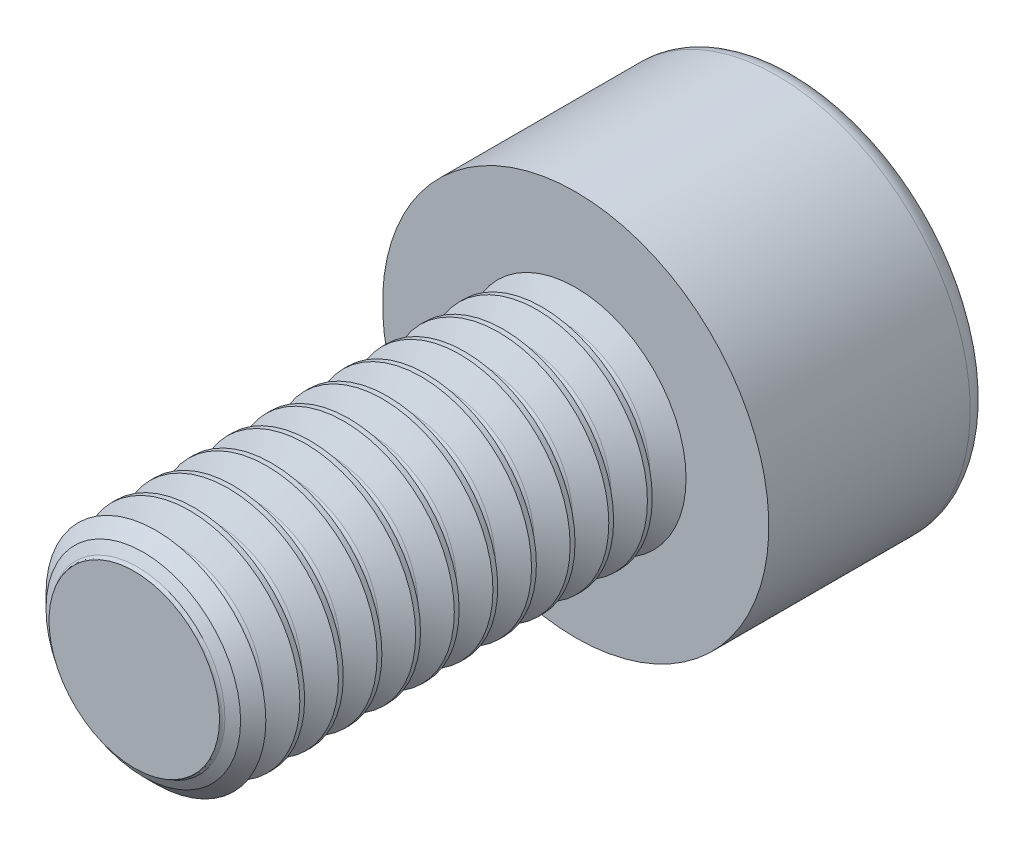
ISO-10303-21;
HEADER;
FILE_DESCRIPTION(('STEP AP214'),'2;1');
FILE_NAME('part.step','',(''),(''),'','','');
FILE_SCHEMA(('AUTOMOTIVE_DESIGN { 1 0 10303 214 1 1 1 1 }'));
ENDSEC;
DATA;
#1=APPLICATION_CONTEXT('core data for automotive mechanical design processes');
#2=APPLICATION_PROTOCOL_DEFINITION('international standard','automotive_design',2000,#1);
#3=PRODUCT_CONTEXT('',#1,'mechanical');
#4=PRODUCT('Part','Part','',(#3));
#5=PRODUCT_RELATED_PRODUCT_CATEGORY('part','',(#4));
#6=PRODUCT_DEFINITION_FORMATION('','',#4);
#7=PRODUCT_DEFINITION_CONTEXT('part definition',#1,'design');
#8=PRODUCT_DEFINITION('design','',#6,#7);
#9=PRODUCT_DEFINITION_SHAPE('','',#8);
#10=(LENGTH_UNIT() NAMED_UNIT(*) SI_UNIT(.MILLI.,.METRE.));
#11=(NAMED_UNIT(*) PLANE_ANGLE_UNIT() SI_UNIT($,.RADIAN.));
#12=(NAMED_UNIT(*) SI_UNIT($,.STERADIAN.) SOLID_ANGLE_UNIT());
#13=UNCERTAINTY_MEASURE_WITH_UNIT(LENGTH_MEASURE(1.E-05),#10,'distance_accuracy_value','');
#14=(GEOMETRIC_REPRESENTATION_CONTEXT(3) GLOBAL_UNCERTAINTY_ASSIGNED_CONTEXT((#13)) GLOBAL_UNIT_ASSIGNED_CONTEXT((#10,
#11,#12)) REPRESENTATION_CONTEXT('',''));
#15=CARTESIAN_POINT('',(0.,0.,0.));
#16=DIRECTION('',(0.,0.,1.));
#17=DIRECTION('',(1.,0.,0.));
#18=AXIS2_PLACEMENT_3D('',#15,#16,#17);
#19=CARTESIAN_POINT('',(0.,0.,-4.));
#20=DIRECTION('',(0.,0.,1.));
#21=DIRECTION('',(0.,-1.,0.));
#22=AXIS2_PLACEMENT_3D('',#19,#20,#21);
#23=PLANE('',#22);
#24=CARTESIAN_POINT('',(0.,0.,-4.));
#25=DIRECTION('',(0.,0.,-1.));
#26=DIRECTION('',(0.,1.,0.));
#27=AXIS2_PLACEMENT_3D('',#24,#25,#26);
#28=CIRCLE('',#27,3.15);
#29=CARTESIAN_POINT('',(0.,3.15,-4.));
#30=VERTEX_POINT('',#29);
#31=EDGE_CURVE('E127',#30,#30,#28,.T.);
#32=ORIENTED_EDGE('',*,*,#31,.T.);
#33=EDGE_LOOP('',(#32));
#34=FACE_BOUND('',#33,.T.);
#35=DIRECTION('',(-0.5,0.866025403784438,0.));
#36=VECTOR('',#35,1.);
#37=CARTESIAN_POINT('',(1.73205080756888,0.,-4.));
#38=LINE('',#37,#36);
#39=CARTESIAN_POINT('',(1.73205080756888,0.,-4.));
#40=VERTEX_POINT('',#39);
#41=CARTESIAN_POINT('',(0.866025403784438,1.5,-4.));
#42=VERTEX_POINT('',#41);
#43=EDGE_CURVE('E65',#40,#42,#38,.T.);
#44=ORIENTED_EDGE('',*,*,#43,.T.);
#45=DIRECTION('',(-1.,0.,0.));
#46=VECTOR('',#45,1.);
#47=CARTESIAN_POINT('',(0.866025403784438,1.5,-4.));
#48=LINE('',#47,#46);
#49=CARTESIAN_POINT('',(-0.866025403784439,1.5,-4.));
#50=VERTEX_POINT('',#49);
#51=EDGE_CURVE('E142',#42,#50,#48,.T.);
#52=ORIENTED_EDGE('',*,*,#51,.T.);
#53=DIRECTION('',(-0.5,-0.866025403784438,0.));
#54=VECTOR('',#53,1.);
#55=CARTESIAN_POINT('',(-0.866025403784439,1.5,-4.));
#56=LINE('',#55,#54);
#57=CARTESIAN_POINT('',(-1.73205080756888,0.,-4.));
#58=VERTEX_POINT('',#57);
#59=EDGE_CURVE('E145',#50,#58,#56,.T.);
#60=ORIENTED_EDGE('',*,*,#59,.T.);
#61=DIRECTION('',(0.5,-0.866025403784439,0.));
#62=VECTOR('',#61,1.);
#63=CARTESIAN_POINT('',(-1.73205080756888,0.,-4.));
#64=LINE('',#63,#62);
#65=CARTESIAN_POINT('',(-0.866025403784439,-1.5,-4.));
#66=VERTEX_POINT('',#65);
#67=EDGE_CURVE('E148',#58,#66,#64,.T.);
#68=ORIENTED_EDGE('',*,*,#67,.T.);
#69=DIRECTION('',(1.,0.,0.));
#70=VECTOR('',#69,1.);
#71=CARTESIAN_POINT('',(-0.866025403784439,-1.5,-4.));
#72=LINE('',#71,#70);
#73=CARTESIAN_POINT('',(0.866025403784439,-1.5,-4.));
#74=VERTEX_POINT('',#73);
#75=EDGE_CURVE('E112',#66,#74,#72,.T.);
#76=ORIENTED_EDGE('',*,*,#75,.T.);
#77=DIRECTION('',(0.5,0.866025403784439,0.));
#78=VECTOR('',#77,1.);
#79=CARTESIAN_POINT('',(0.866025403784439,-1.5,-4.));
#80=LINE('',#79,#78);
#81=EDGE_CURVE('E107',#74,#40,#80,.T.);
#82=ORIENTED_EDGE('',*,*,#81,.T.);
#83=EDGE_LOOP('',(#44,#52,#60,#68,#76,#82));
#84=FACE_BOUND('',#83,.T.);
#85=ADVANCED_FACE('F48',(#34,#84),#23,.F.);
#86=CARTESIAN_POINT('',(0.,0.,8.));
#87=DIRECTION('',(0.,0.,1.));
#88=DIRECTION('',(0.,-1.,0.));
#89=AXIS2_PLACEMENT_3D('',#86,#87,#88);
#90=CYLINDRICAL_SURFACE('',#89,2.);
#91=CARTESIAN_POINT('',(0.,0.,0.700000000000002));
#92=DIRECTION('',(0.,0.,1.));
#93=DIRECTION('',(1.,0.,0.));
#94=AXIS2_PLACEMENT_3D('',#91,#92,#93);
#95=CIRCLE('',#94,2.);
#96=CARTESIAN_POINT('',(2.,0.,0.700000000000002));
#97=VERTEX_POINT('',#96);
#98=EDGE_CURVE('E275',#97,#97,#95,.T.);
#99=ORIENTED_EDGE('',*,*,#98,.F.);
#100=EDGE_LOOP('',(#99));
#101=FACE_BOUND('',#100,.T.);
#102=CARTESIAN_POINT('',(0.,0.,0.612499999999998));
#103=DIRECTION('',(0.,0.,1.));
#104=DIRECTION('',(1.,0.,0.));
#105=AXIS2_PLACEMENT_3D('',#102,#103,#104);
#106=CIRCLE('',#105,2.);
#107=CARTESIAN_POINT('',(2.,0.,0.612499999999998));
#108=VERTEX_POINT('',#107);
#109=EDGE_CURVE('E13',#108,#108,#106,.T.);
#110=ORIENTED_EDGE('',*,*,#109,.T.);
#111=EDGE_LOOP('',(#110));
#112=FACE_BOUND('',#111,.T.);
#113=ADVANCED_FACE('F50',(#101,#112),#90,.T.);
#114=CARTESIAN_POINT('',(0.,0.,0.371875));
#115=DIRECTION('',(0.,0.,1.));
#116=DIRECTION('',(1.,0.,0.));
#117=AXIS2_PLACEMENT_3D('',#114,#115,#116);
#118=CONICAL_SURFACE('',#117,1.58322527442874,1.0471975511966);
#119=ORIENTED_EDGE('',*,*,#109,.F.);
#120=EDGE_LOOP('',(#119));
#121=FACE_BOUND('',#120,.T.);
#122=CARTESIAN_POINT('',(0.,0.,0.371875));
#123=DIRECTION('',(0.,0.,1.));
#124=DIRECTION('',(1.,0.,0.));
#125=AXIS2_PLACEMENT_3D('',#122,#123,#124);
#126=CIRCLE('',#125,1.58322527442874);
#127=CARTESIAN_POINT('',(1.58322527442874,0.,0.371875));
#128=VERTEX_POINT('',#127);
#129=EDGE_CURVE('E281',#128,#128,#126,.T.);
#130=ORIENTED_EDGE('',*,*,#129,.T.);
#131=EDGE_LOOP('',(#130));
#132=FACE_BOUND('',#131,.T.);
#133=ADVANCED_FACE('F316',(#121,#132),#118,.T.);
#134=CARTESIAN_POINT('',(0.,0.,0.));
#135=DIRECTION('',(0.,0.,-1.));
#136=DIRECTION('',(-1.,0.,0.));
#137=AXIS2_PLACEMENT_3D('',#134,#135,#136);
#138=CONICAL_SURFACE('',#137,2.,1.0471975511966);
#139=CARTESIAN_POINT('',(0.,0.,0.240625));
#140=DIRECTION('',(0.,0.,1.));
#141=DIRECTION('',(1.,0.,0.));
#142=AXIS2_PLACEMENT_3D('',#139,#140,#141);
#143=CIRCLE('',#142,1.58322527442874);
#144=CARTESIAN_POINT('',(1.58322527442874,0.,0.240625));
#145=VERTEX_POINT('',#144);
#146=EDGE_CURVE('E57',#145,#145,#143,.T.);
#147=ORIENTED_EDGE('',*,*,#146,.F.);
#148=EDGE_LOOP('',(#147));
#149=FACE_BOUND('',#148,.T.);
#150=CARTESIAN_POINT('',(0.,0.,0.));
#151=DIRECTION('',(0.,0.,-1.));
#152=DIRECTION('',(0.,1.,0.));
#153=AXIS2_PLACEMENT_3D('',#150,#151,#152);
#154=CIRCLE('',#153,2.);
#155=CARTESIAN_POINT('',(0.,2.,0.));
#156=VERTEX_POINT('',#155);
#157=EDGE_CURVE('E156',#156,#156,#154,.T.);
#158=ORIENTED_EDGE('',*,*,#157,.F.);
#159=EDGE_LOOP('',(#158));
#160=FACE_BOUND('',#159,.T.);
#161=ADVANCED_FACE('F341',(#149,#160),#138,.T.);
#162=CARTESIAN_POINT('',(0.,0.,0.30625));
#163=DIRECTION('',(0.,0.,1.));
#164=DIRECTION('',(1.,0.,0.));
#165=AXIS2_PLACEMENT_3D('',#162,#163,#164);
#166=TOROIDAL_SURFACE('',#165,1.62111388584431,0.0757772228311381);
#167=ORIENTED_EDGE('',*,*,#129,.F.);
#168=EDGE_LOOP('',(#167));
#169=FACE_BOUND('',#168,.T.);
#170=ORIENTED_EDGE('',*,*,#146,.T.);
#171=EDGE_LOOP('',(#170));
#172=FACE_BOUND('',#171,.T.);
#173=ADVANCED_FACE('F343',(#169,#172),#166,.F.);
#174=CARTESIAN_POINT('',(0.,0.,1.071875));
#175=DIRECTION('',(0.,0.,1.));
#176=DIRECTION('',(1.,0.,0.));
#177=AXIS2_PLACEMENT_3D('',#174,#175,#176);
#178=CONICAL_SURFACE('',#177,1.58322527442874,1.0471975511966);
#179=CARTESIAN_POINT('',(0.,0.,1.3125));
#180=DIRECTION('',(0.,0.,1.));
#181=DIRECTION('',(1.,0.,0.));
#182=AXIS2_PLACEMENT_3D('',#179,#180,#181);
#183=CIRCLE('',#182,2.);
#184=CARTESIAN_POINT('',(2.,0.,1.3125));
#185=VERTEX_POINT('',#184);
#186=EDGE_CURVE('E278',#185,#185,#183,.T.);
#187=ORIENTED_EDGE('',*,*,#186,.F.);
#188=EDGE_LOOP('',(#187));
#189=FACE_BOUND('',#188,.T.);
#190=CARTESIAN_POINT('',(0.,0.,1.071875));
#191=DIRECTION('',(0.,0.,1.));
#192=DIRECTION('',(1.,0.,0.));
#193=AXIS2_PLACEMENT_3D('',#190,#191,#192);
#194=CIRCLE('',#193,1.58322527442874);
#195=CARTESIAN_POINT('',(1.58322527442874,0.,1.071875));
#196=VERTEX_POINT('',#195);
#197=EDGE_CURVE('E269',#196,#196,#194,.T.);
#198=ORIENTED_EDGE('',*,*,#197,.T.);
#199=EDGE_LOOP('',(#198));
#200=FACE_BOUND('',#199,.T.);
#201=ADVANCED_FACE('F350',(#189,#200),#178,.T.);
#202=CARTESIAN_POINT('',(0.,0.,0.700000000000002));
#203=DIRECTION('',(0.,0.,-1.));
#204=DIRECTION('',(-1.,0.,0.));
#205=AXIS2_PLACEMENT_3D('',#202,#203,#204);
#206=CONICAL_SURFACE('',#205,2.,1.0471975511966);
#207=CARTESIAN_POINT('',(0.,0.,0.940625));
#208=DIRECTION('',(0.,0.,1.));
#209=DIRECTION('',(1.,0.,0.));
#210=AXIS2_PLACEMENT_3D('',#207,#208,#209);
#211=CIRCLE('',#210,1.58322527442874);
#212=CARTESIAN_POINT('',(1.58322527442874,0.,0.940625));
#213=VERTEX_POINT('',#212);
#214=EDGE_CURVE('E272',#213,#213,#211,.T.);
#215=ORIENTED_EDGE('',*,*,#214,.F.);
#216=EDGE_LOOP('',(#215));
#217=FACE_BOUND('',#216,.T.);
#218=ORIENTED_EDGE('',*,*,#98,.T.);
#219=EDGE_LOOP('',(#218));
#220=FACE_BOUND('',#219,.T.);
#221=ADVANCED_FACE('F733',(#217,#220),#206,.T.);
#222=CARTESIAN_POINT('',(0.,0.,1.00625));
#223=DIRECTION('',(0.,0.,1.));
#224=DIRECTION('',(1.,0.,0.));
#225=AXIS2_PLACEMENT_3D('',#222,#223,#224);
#226=TOROIDAL_SURFACE('',#225,1.62111388584431,0.0757772228311381);
#227=ORIENTED_EDGE('',*,*,#197,.F.);
#228=EDGE_LOOP('',(#227));
#229=FACE_BOUND('',#228,.T.);
#230=ORIENTED_EDGE('',*,*,#214,.T.);
#231=EDGE_LOOP('',(#230));
#232=FACE_BOUND('',#231,.T.);
#233=ADVANCED_FACE('F727',(#229,#232),#226,.F.);
#234=CARTESIAN_POINT('',(0.,0.,1.4));
#235=DIRECTION('',(0.,0.,1.));
#236=DIRECTION('',(1.,0.,0.));
#237=AXIS2_PLACEMENT_3D('',#234,#235,#236);
#238=CIRCLE('',#237,2.);
#239=CARTESIAN_POINT('',(2.,0.,1.4));
#240=VERTEX_POINT('',#239);
#241=EDGE_CURVE('E263',#240,#240,#238,.T.);
#242=ORIENTED_EDGE('',*,*,#241,.F.);
#243=EDGE_LOOP('',(#242));
#244=FACE_BOUND('',#243,.T.);
#245=ORIENTED_EDGE('',*,*,#186,.T.);
#246=EDGE_LOOP('',(#245));
#247=FACE_BOUND('',#246,.T.);
#248=ADVANCED_FACE('F319',(#244,#247),#90,.T.);
#249=CARTESIAN_POINT('',(0.,0.,1.771875));
#250=DIRECTION('',(0.,0.,1.));
#251=DIRECTION('',(1.,0.,0.));
#252=AXIS2_PLACEMENT_3D('',#249,#250,#251);
#253=CONICAL_SURFACE('',#252,1.58322527442874,1.0471975511966);
#254=CARTESIAN_POINT('',(0.,0.,2.0125));
#255=DIRECTION('',(0.,0.,1.));
#256=DIRECTION('',(1.,0.,0.));
#257=AXIS2_PLACEMENT_3D('',#254,#255,#256);
#258=CIRCLE('',#257,2.);
#259=CARTESIAN_POINT('',(2.,0.,2.0125));
#260=VERTEX_POINT('',#259);
#261=EDGE_CURVE('E266',#260,#260,#258,.T.);
#262=ORIENTED_EDGE('',*,*,#261,.F.);
#263=EDGE_LOOP('',(#262));
#264=FACE_BOUND('',#263,.T.);
#265=CARTESIAN_POINT('',(0.,0.,1.771875));
#266=DIRECTION('',(0.,0.,1.));
#267=DIRECTION('',(1.,0.,0.));
#268=AXIS2_PLACEMENT_3D('',#265,#266,#267);
#269=CIRCLE('',#268,1.58322527442874);
#270=CARTESIAN_POINT('',(1.58322527442874,0.,1.771875));
#271=VERTEX_POINT('',#270);
#272=EDGE_CURVE('E257',#271,#271,#269,.T.);
#273=ORIENTED_EDGE('',*,*,#272,.T.);
#274=EDGE_LOOP('',(#273));
#275=FACE_BOUND('',#274,.T.);
#276=ADVANCED_FACE('F714',(#264,#275),#253,.T.);
#277=CARTESIAN_POINT('',(0.,0.,1.4));
#278=DIRECTION('',(0.,0.,-1.));
#279=DIRECTION('',(-1.,0.,0.));
#280=AXIS2_PLACEMENT_3D('',#277,#278,#279);
#281=CONICAL_SURFACE('',#280,2.,1.0471975511966);
#282=CARTESIAN_POINT('',(0.,0.,1.640625));
#283=DIRECTION('',(0.,0.,1.));
#284=DIRECTION('',(1.,0.,0.));
#285=AXIS2_PLACEMENT_3D('',#282,#283,#284);
#286=CIRCLE('',#285,1.58322527442874);
#287=CARTESIAN_POINT('',(1.58322527442874,0.,1.640625));
#288=VERTEX_POINT('',#287);
#289=EDGE_CURVE('E260',#288,#288,#286,.T.);
#290=ORIENTED_EDGE('',*,*,#289,.F.);
#291=EDGE_LOOP('',(#290));
#292=FACE_BOUND('',#291,.T.);
#293=ORIENTED_EDGE('',*,*,#241,.T.);
#294=EDGE_LOOP('',(#293));
#295=FACE_BOUND('',#294,.T.);
#296=ADVANCED_FACE('F705',(#292,#295),#281,.T.);
#297=CARTESIAN_POINT('',(0.,0.,1.70625));
#298=DIRECTION('',(0.,0.,1.));
#299=DIRECTION('',(1.,0.,0.));
#300=AXIS2_PLACEMENT_3D('',#297,#298,#299);
#301=TOROIDAL_SURFACE('',#300,1.62111388584431,0.0757772228311381);
#302=ORIENTED_EDGE('',*,*,#272,.F.);
#303=EDGE_LOOP('',(#302));
#304=FACE_BOUND('',#303,.T.);
#305=ORIENTED_EDGE('',*,*,#289,.T.);
#306=EDGE_LOOP('',(#305));
#307=FACE_BOUND('',#306,.T.);
#308=ADVANCED_FACE('F699',(#304,#307),#301,.F.);
#309=CARTESIAN_POINT('',(0.,0.,2.1));
#310=DIRECTION('',(0.,0.,1.));
#311=DIRECTION('',(1.,0.,0.));
#312=AXIS2_PLACEMENT_3D('',#309,#310,#311);
#313=CIRCLE('',#312,2.);
#314=CARTESIAN_POINT('',(2.,0.,2.1));
#315=VERTEX_POINT('',#314);
#316=EDGE_CURVE('E251',#315,#315,#313,.T.);
#317=ORIENTED_EDGE('',*,*,#316,.F.);
#318=EDGE_LOOP('',(#317));
#319=FACE_BOUND('',#318,.T.);
#320=ORIENTED_EDGE('',*,*,#261,.T.);
#321=EDGE_LOOP('',(#320));
#322=FACE_BOUND('',#321,.T.);
#323=ADVANCED_FACE('F694',(#319,#322),#90,.T.);
#324=CARTESIAN_POINT('',(0.,0.,2.471875));
#325=DIRECTION('',(0.,0.,1.));
#326=DIRECTION('',(1.,0.,0.));
#327=AXIS2_PLACEMENT_3D('',#324,#325,#326);
#328=CONICAL_SURFACE('',#327,1.58322527442874,1.0471975511966);
#329=CARTESIAN_POINT('',(0.,0.,2.7125));
#330=DIRECTION('',(0.,0.,1.));
#331=DIRECTION('',(1.,0.,0.));
#332=AXIS2_PLACEMENT_3D('',#329,#330,#331);
#333=CIRCLE('',#332,2.);
#334=CARTESIAN_POINT('',(2.,0.,2.7125));
#335=VERTEX_POINT('',#334);
#336=EDGE_CURVE('E254',#335,#335,#333,.T.);
#337=ORIENTED_EDGE('',*,*,#336,.F.);
#338=EDGE_LOOP('',(#337));
#339=FACE_BOUND('',#338,.T.);
#340=CARTESIAN_POINT('',(0.,0.,2.471875));
#341=DIRECTION('',(0.,0.,1.));
#342=DIRECTION('',(1.,0.,0.));
#343=AXIS2_PLACEMENT_3D('',#340,#341,#342);
#344=CIRCLE('',#343,1.58322527442874);
#345=CARTESIAN_POINT('',(1.58322527442874,0.,2.471875));
#346=VERTEX_POINT('',#345);
#347=EDGE_CURVE('E245',#346,#346,#344,.T.);
#348=ORIENTED_EDGE('',*,*,#347,.T.);
#349=EDGE_LOOP('',(#348));
#350=FACE_BOUND('',#349,.T.);
#351=ADVANCED_FACE('F685',(#339,#350),#328,.T.);
#352=CARTESIAN_POINT('',(0.,0.,2.1));
#353=DIRECTION('',(0.,0.,-1.));
#354=DIRECTION('',(-1.,0.,0.));
#355=AXIS2_PLACEMENT_3D('',#352,#353,#354);
#356=CONICAL_SURFACE('',#355,2.,1.0471975511966);
#357=CARTESIAN_POINT('',(0.,0.,2.340625));
#358=DIRECTION('',(0.,0.,1.));
#359=DIRECTION('',(1.,0.,0.));
#360=AXIS2_PLACEMENT_3D('',#357,#358,#359);
#361=CIRCLE('',#360,1.58322527442874);
#362=CARTESIAN_POINT('',(1.58322527442874,0.,2.340625));
#363=VERTEX_POINT('',#362);
#364=EDGE_CURVE('E248',#363,#363,#361,.T.);
#365=ORIENTED_EDGE('',*,*,#364,.F.);
#366=EDGE_LOOP('',(#365));
#367=FACE_BOUND('',#366,.T.);
#368=ORIENTED_EDGE('',*,*,#316,.T.);
#369=EDGE_LOOP('',(#368));
#370=FACE_BOUND('',#369,.T.);
#371=ADVANCED_FACE('F676',(#367,#370),#356,.T.);
#372=CARTESIAN_POINT('',(0.,0.,2.40625));
#373=DIRECTION('',(0.,0.,1.));
#374=DIRECTION('',(1.,0.,0.));
#375=AXIS2_PLACEMENT_3D('',#372,#373,#374);
#376=TOROIDAL_SURFACE('',#375,1.62111388584431,0.0757772228311381);
#377=ORIENTED_EDGE('',*,*,#347,.F.);
#378=EDGE_LOOP('',(#377));
#379=FACE_BOUND('',#378,.T.);
#380=ORIENTED_EDGE('',*,*,#364,.T.);
#381=EDGE_LOOP('',(#380));
#382=FACE_BOUND('',#381,.T.);
#383=ADVANCED_FACE('F670',(#379,#382),#376,.F.);
#384=CARTESIAN_POINT('',(0.,0.,2.8));
#385=DIRECTION('',(0.,0.,1.));
#386=DIRECTION('',(1.,0.,0.));
#387=AXIS2_PLACEMENT_3D('',#384,#385,#386);
#388=CIRCLE('',#387,2.);
#389=CARTESIAN_POINT('',(2.,0.,2.8));
#390=VERTEX_POINT('',#389);
#391=EDGE_CURVE('E239',#390,#390,#388,.T.);
#392=ORIENTED_EDGE('',*,*,#391,.F.);
#393=EDGE_LOOP('',(#392));
#394=FACE_BOUND('',#393,.T.);
#395=ORIENTED_EDGE('',*,*,#336,.T.);
#396=EDGE_LOOP('',(#395));
#397=FACE_BOUND('',#396,.T.);
#398=ADVANCED_FACE('F665',(#394,#397),#90,.T.);
#399=CARTESIAN_POINT('',(0.,0.,3.171875));
#400=DIRECTION('',(0.,0.,1.));
#401=DIRECTION('',(1.,0.,0.));
#402=AXIS2_PLACEMENT_3D('',#399,#400,#401);
#403=CONICAL_SURFACE('',#402,1.58322527442874,1.0471975511966);
#404=CARTESIAN_POINT('',(0.,0.,3.4125));
#405=DIRECTION('',(0.,0.,1.));
#406=DIRECTION('',(1.,0.,0.));
#407=AXIS2_PLACEMENT_3D('',#404,#405,#406);
#408=CIRCLE('',#407,2.);
#409=CARTESIAN_POINT('',(2.,0.,3.4125));
#410=VERTEX_POINT('',#409);
#411=EDGE_CURVE('E242',#410,#410,#408,.T.);
#412=ORIENTED_EDGE('',*,*,#411,.F.);
#413=EDGE_LOOP('',(#412));
#414=FACE_BOUND('',#413,.T.);
#415=CARTESIAN_POINT('',(0.,0.,3.171875));
#416=DIRECTION('',(0.,0.,1.));
#417=DIRECTION('',(1.,0.,0.));
#418=AXIS2_PLACEMENT_3D('',#415,#416,#417);
#419=CIRCLE('',#418,1.58322527442874);
#420=CARTESIAN_POINT('',(1.58322527442874,0.,3.171875));
#421=VERTEX_POINT('',#420);
#422=EDGE_CURVE('E233',#421,#421,#419,.T.);
#423=ORIENTED_EDGE('',*,*,#422,.T.);
#424=EDGE_LOOP('',(#423));
#425=FACE_BOUND('',#424,.T.);
#426=ADVANCED_FACE('F656',(#414,#425),#403,.T.);
#427=CARTESIAN_POINT('',(0.,0.,2.8));
#428=DIRECTION('',(0.,0.,-1.));
#429=DIRECTION('',(-1.,0.,0.));
#430=AXIS2_PLACEMENT_3D('',#427,#428,#429);
#431=CONICAL_SURFACE('',#430,2.,1.0471975511966);
#432=CARTESIAN_POINT('',(0.,0.,3.040625));
#433=DIRECTION('',(0.,0.,1.));
#434=DIRECTION('',(1.,0.,0.));
#435=AXIS2_PLACEMENT_3D('',#432,#433,#434);
#436=CIRCLE('',#435,1.58322527442874);
#437=CARTESIAN_POINT('',(1.58322527442874,0.,3.040625));
#438=VERTEX_POINT('',#437);
#439=EDGE_CURVE('E236',#438,#438,#436,.T.);
#440=ORIENTED_EDGE('',*,*,#439,.F.);
#441=EDGE_LOOP('',(#440));
#442=FACE_BOUND('',#441,.T.);
#443=ORIENTED_EDGE('',*,*,#391,.T.);
#444=EDGE_LOOP('',(#443));
#445=FACE_BOUND('',#444,.T.);
#446=ADVANCED_FACE('F647',(#442,#445),#431,.T.);
#447=CARTESIAN_POINT('',(0.,0.,3.10625));
#448=DIRECTION('',(0.,0.,1.));
#449=DIRECTION('',(1.,0.,0.));
#450=AXIS2_PLACEMENT_3D('',#447,#448,#449);
#451=TOROIDAL_SURFACE('',#450,1.62111388584431,0.0757772228311381);
#452=ORIENTED_EDGE('',*,*,#422,.F.);
#453=EDGE_LOOP('',(#452));
#454=FACE_BOUND('',#453,.T.);
#455=ORIENTED_EDGE('',*,*,#439,.T.);
#456=EDGE_LOOP('',(#455));
#457=FACE_BOUND('',#456,.T.);
#458=ADVANCED_FACE('F641',(#454,#457),#451,.F.);
#459=CARTESIAN_POINT('',(0.,0.,3.5));
#460=DIRECTION('',(0.,0.,1.));
#461=DIRECTION('',(1.,0.,0.));
#462=AXIS2_PLACEMENT_3D('',#459,#460,#461);
#463=CIRCLE('',#462,2.);
#464=CARTESIAN_POINT('',(2.,0.,3.5));
#465=VERTEX_POINT('',#464);
#466=EDGE_CURVE('E227',#465,#465,#463,.T.);
#467=ORIENTED_EDGE('',*,*,#466,.F.);
#468=EDGE_LOOP('',(#467));
#469=FACE_BOUND('',#468,.T.);
#470=ORIENTED_EDGE('',*,*,#411,.T.);
#471=EDGE_LOOP('',(#470));
#472=FACE_BOUND('',#471,.T.);
#473=ADVANCED_FACE('F636',(#469,#472),#90,.T.);
#474=CARTESIAN_POINT('',(0.,0.,3.871875));
#475=DIRECTION('',(0.,0.,1.));
#476=DIRECTION('',(1.,0.,0.));
#477=AXIS2_PLACEMENT_3D('',#474,#475,#476);
#478=CONICAL_SURFACE('',#477,1.58322527442874,1.0471975511966);
#479=CARTESIAN_POINT('',(0.,0.,4.1125));
#480=DIRECTION('',(0.,0.,1.));
#481=DIRECTION('',(1.,0.,0.));
#482=AXIS2_PLACEMENT_3D('',#479,#480,#481);
#483=CIRCLE('',#482,2.);
#484=CARTESIAN_POINT('',(2.,0.,4.1125));
#485=VERTEX_POINT('',#484);
#486=EDGE_CURVE('E230',#485,#485,#483,.T.);
#487=ORIENTED_EDGE('',*,*,#486,.F.);
#488=EDGE_LOOP('',(#487));
#489=FACE_BOUND('',#488,.T.);
#490=CARTESIAN_POINT('',(0.,0.,3.871875));
#491=DIRECTION('',(0.,0.,1.));
#492=DIRECTION('',(1.,0.,0.));
#493=AXIS2_PLACEMENT_3D('',#490,#491,#492);
#494=CIRCLE('',#493,1.58322527442874);
#495=CARTESIAN_POINT('',(1.58322527442874,0.,3.871875));
#496=VERTEX_POINT('',#495);
#497=EDGE_CURVE('E221',#496,#496,#494,.T.);
#498=ORIENTED_EDGE('',*,*,#497,.T.);
#499=EDGE_LOOP('',(#498));
#500=FACE_BOUND('',#499,.T.);
#501=ADVANCED_FACE('F627',(#489,#500),#478,.T.);
#502=CARTESIAN_POINT('',(0.,0.,3.5));
#503=DIRECTION('',(0.,0.,-1.));
#504=DIRECTION('',(-1.,0.,0.));
#505=AXIS2_PLACEMENT_3D('',#502,#503,#504);
#506=CONICAL_SURFACE('',#505,2.,1.0471975511966);
#507=CARTESIAN_POINT('',(0.,0.,3.740625));
#508=DIRECTION('',(0.,0.,1.));
#509=DIRECTION('',(1.,0.,0.));
#510=AXIS2_PLACEMENT_3D('',#507,#508,#509);
#511=CIRCLE('',#510,1.58322527442874);
#512=CARTESIAN_POINT('',(1.58322527442874,0.,3.740625));
#513=VERTEX_POINT('',#512);
#514=EDGE_CURVE('E224',#513,#513,#511,.T.);
#515=ORIENTED_EDGE('',*,*,#514,.F.);
#516=EDGE_LOOP('',(#515));
#517=FACE_BOUND('',#516,.T.);
#518=ORIENTED_EDGE('',*,*,#466,.T.);
#519=EDGE_LOOP('',(#518));
#520=FACE_BOUND('',#519,.T.);
#521=ADVANCED_FACE('F618',(#517,#520),#506,.T.);
#522=CARTESIAN_POINT('',(0.,0.,3.80625));
#523=DIRECTION('',(0.,0.,1.));
#524=DIRECTION('',(1.,0.,0.));
#525=AXIS2_PLACEMENT_3D('',#522,#523,#524);
#526=TOROIDAL_SURFACE('',#525,1.62111388584431,0.0757772228311381);
#527=ORIENTED_EDGE('',*,*,#497,.F.);
#528=EDGE_LOOP('',(#527));
#529=FACE_BOUND('',#528,.T.);
#530=ORIENTED_EDGE('',*,*,#514,.T.);
#531=EDGE_LOOP('',(#530));
#532=FACE_BOUND('',#531,.T.);
#533=ADVANCED_FACE('F612',(#529,#532),#526,.F.);
#534=CARTESIAN_POINT('',(0.,0.,4.2));
#535=DIRECTION('',(0.,0.,1.));
#536=DIRECTION('',(1.,0.,0.));
#537=AXIS2_PLACEMENT_3D('',#534,#535,#536);
#538=CIRCLE('',#537,2.);
#539=CARTESIAN_POINT('',(2.,0.,4.2));
#540=VERTEX_POINT('',#539);
#541=EDGE_CURVE('E215',#540,#540,#538,.T.);
#542=ORIENTED_EDGE('',*,*,#541,.F.);
#543=EDGE_LOOP('',(#542));
#544=FACE_BOUND('',#543,.T.);
#545=ORIENTED_EDGE('',*,*,#486,.T.);
#546=EDGE_LOOP('',(#545));
#547=FACE_BOUND('',#546,.T.);
#548=ADVANCED_FACE('F607',(#544,#547),#90,.T.);
#549=CARTESIAN_POINT('',(0.,0.,4.571875));
#550=DIRECTION('',(0.,0.,1.));
#551=DIRECTION('',(1.,0.,0.));
#552=AXIS2_PLACEMENT_3D('',#549,#550,#551);
#553=CONICAL_SURFACE('',#552,1.58322527442874,1.0471975511966);
#554=CARTESIAN_POINT('',(0.,0.,4.8125));
#555=DIRECTION('',(0.,0.,1.));
#556=DIRECTION('',(1.,0.,0.));
#557=AXIS2_PLACEMENT_3D('',#554,#555,#556);
#558=CIRCLE('',#557,2.);
#559=CARTESIAN_POINT('',(2.,0.,4.8125));
#560=VERTEX_POINT('',#559);
#561=EDGE_CURVE('E218',#560,#560,#558,.T.);
#562=ORIENTED_EDGE('',*,*,#561,.F.);
#563=EDGE_LOOP('',(#562));
#564=FACE_BOUND('',#563,.T.);
#565=CARTESIAN_POINT('',(0.,0.,4.571875));
#566=DIRECTION('',(0.,0.,1.));
#567=DIRECTION('',(1.,0.,0.));
#568=AXIS2_PLACEMENT_3D('',#565,#566,#567);
#569=CIRCLE('',#568,1.58322527442874);
#570=CARTESIAN_POINT('',(1.58322527442874,0.,4.571875));
#571=VERTEX_POINT('',#570);
#572=EDGE_CURVE('E209',#571,#571,#569,.T.);
#573=ORIENTED_EDGE('',*,*,#572,.T.);
#574=EDGE_LOOP('',(#573));
#575=FACE_BOUND('',#574,.T.);
#576=ADVANCED_FACE('F598',(#564,#575),#553,.T.);
#577=CARTESIAN_POINT('',(0.,0.,4.2));
#578=DIRECTION('',(0.,0.,-1.));
#579=DIRECTION('',(-1.,0.,0.));
#580=AXIS2_PLACEMENT_3D('',#577,#578,#579);
#581=CONICAL_SURFACE('',#580,2.,1.0471975511966);
#582=CARTESIAN_POINT('',(0.,0.,4.440625));
#583=DIRECTION('',(0.,0.,1.));
#584=DIRECTION('',(1.,0.,0.));
#585=AXIS2_PLACEMENT_3D('',#582,#583,#584);
#586=CIRCLE('',#585,1.58322527442874);
#587=CARTESIAN_POINT('',(1.58322527442874,0.,4.440625));
#588=VERTEX_POINT('',#587);
#589=EDGE_CURVE('E212',#588,#588,#586,.T.);
#590=ORIENTED_EDGE('',*,*,#589,.F.);
#591=EDGE_LOOP('',(#590));
#592=FACE_BOUND('',#591,.T.);
#593=ORIENTED_EDGE('',*,*,#541,.T.);
#594=EDGE_LOOP('',(#593));
#595=FACE_BOUND('',#594,.T.);
#596=ADVANCED_FACE('F589',(#592,#595),#581,.T.);
#597=CARTESIAN_POINT('',(0.,0.,4.50625));
#598=DIRECTION('',(0.,0.,1.));
#599=DIRECTION('',(1.,0.,0.));
#600=AXIS2_PLACEMENT_3D('',#597,#598,#599);
#601=TOROIDAL_SURFACE('',#600,1.62111388584431,0.0757772228311381);
#602=ORIENTED_EDGE('',*,*,#572,.F.);
#603=EDGE_LOOP('',(#602));
#604=FACE_BOUND('',#603,.T.);
#605=ORIENTED_EDGE('',*,*,#589,.T.);
#606=EDGE_LOOP('',(#605));
#607=FACE_BOUND('',#606,.T.);
#608=ADVANCED_FACE('F583',(#604,#607),#601,.F.);
#609=CARTESIAN_POINT('',(0.,0.,4.9));
#610=DIRECTION('',(0.,0.,1.));
#611=DIRECTION('',(1.,0.,0.));
#612=AXIS2_PLACEMENT_3D('',#609,#610,#611);
#613=CIRCLE('',#612,2.);
#614=CARTESIAN_POINT('',(2.,0.,4.9));
#615=VERTEX_POINT('',#614);
#616=EDGE_CURVE('E203',#615,#615,#613,.T.);
#617=ORIENTED_EDGE('',*,*,#616,.F.);
#618=EDGE_LOOP('',(#617));
#619=FACE_BOUND('',#618,.T.);
#620=ORIENTED_EDGE('',*,*,#561,.T.);
#621=EDGE_LOOP('',(#620));
#622=FACE_BOUND('',#621,.T.);
#623=ADVANCED_FACE('F578',(#619,#622),#90,.T.);
#624=CARTESIAN_POINT('',(0.,0.,5.271875));
#625=DIRECTION('',(0.,0.,1.));
#626=DIRECTION('',(1.,0.,0.));
#627=AXIS2_PLACEMENT_3D('',#624,#625,#626);
#628=CONICAL_SURFACE('',#627,1.58322527442874,1.0471975511966);
#629=CARTESIAN_POINT('',(0.,0.,5.5125));
#630=DIRECTION('',(0.,0.,1.));
#631=DIRECTION('',(1.,0.,0.));
#632=AXIS2_PLACEMENT_3D('',#629,#630,#631);
#633=CIRCLE('',#632,2.);
#634=CARTESIAN_POINT('',(2.,0.,5.5125));
#635=VERTEX_POINT('',#634);
#636=EDGE_CURVE('E206',#635,#635,#633,.T.);
#637=ORIENTED_EDGE('',*,*,#636,.F.);
#638=EDGE_LOOP('',(#637));
#639=FACE_BOUND('',#638,.T.);
#640=CARTESIAN_POINT('',(0.,0.,5.271875));
#641=DIRECTION('',(0.,0.,1.));
#642=DIRECTION('',(1.,0.,0.));
#643=AXIS2_PLACEMENT_3D('',#640,#641,#642);
#644=CIRCLE('',#643,1.58322527442874);
#645=CARTESIAN_POINT('',(1.58322527442874,0.,5.271875));
#646=VERTEX_POINT('',#645);
#647=EDGE_CURVE('E197',#646,#646,#644,.T.);
#648=ORIENTED_EDGE('',*,*,#647,.T.);
#649=EDGE_LOOP('',(#648));
#650=FACE_BOUND('',#649,.T.);
#651=ADVANCED_FACE('F569',(#639,#650),#628,.T.);
#652=CARTESIAN_POINT('',(0.,0.,4.9));
#653=DIRECTION('',(0.,0.,-1.));
#654=DIRECTION('',(-1.,0.,0.));
#655=AXIS2_PLACEMENT_3D('',#652,#653,#654);
#656=CONICAL_SURFACE('',#655,2.,1.0471975511966);
#657=CARTESIAN_POINT('',(0.,0.,5.140625));
#658=DIRECTION('',(0.,0.,1.));
#659=DIRECTION('',(1.,0.,0.));
#660=AXIS2_PLACEMENT_3D('',#657,#658,#659);
#661=CIRCLE('',#660,1.58322527442874);
#662=CARTESIAN_POINT('',(1.58322527442874,0.,5.140625));
#663=VERTEX_POINT('',#662);
#664=EDGE_CURVE('E200',#663,#663,#661,.T.);
#665=ORIENTED_EDGE('',*,*,#664,.F.);
#666=EDGE_LOOP('',(#665));
#667=FACE_BOUND('',#666,.T.);
#668=ORIENTED_EDGE('',*,*,#616,.T.);
#669=EDGE_LOOP('',(#668));
#670=FACE_BOUND('',#669,.T.);
#671=ADVANCED_FACE('F560',(#667,#670),#656,.T.);
#672=CARTESIAN_POINT('',(0.,0.,5.20625));
#673=DIRECTION('',(0.,0.,1.));
#674=DIRECTION('',(1.,0.,0.));
#675=AXIS2_PLACEMENT_3D('',#672,#673,#674);
#676=TOROIDAL_SURFACE('',#675,1.62111388584431,0.0757772228311381);
#677=ORIENTED_EDGE('',*,*,#647,.F.);
#678=EDGE_LOOP('',(#677));
#679=FACE_BOUND('',#678,.T.);
#680=ORIENTED_EDGE('',*,*,#664,.T.);
#681=EDGE_LOOP('',(#680));
#682=FACE_BOUND('',#681,.T.);
#683=ADVANCED_FACE('F554',(#679,#682),#676,.F.);
#684=CARTESIAN_POINT('',(0.,0.,5.6));
#685=DIRECTION('',(0.,0.,1.));
#686=DIRECTION('',(1.,0.,0.));
#687=AXIS2_PLACEMENT_3D('',#684,#685,#686);
#688=CIRCLE('',#687,2.);
#689=CARTESIAN_POINT('',(2.,0.,5.6));
#690=VERTEX_POINT('',#689);
#691=EDGE_CURVE('E191',#690,#690,#688,.T.);
#692=ORIENTED_EDGE('',*,*,#691,.F.);
#693=EDGE_LOOP('',(#692));
#694=FACE_BOUND('',#693,.T.);
#695=ORIENTED_EDGE('',*,*,#636,.T.);
#696=EDGE_LOOP('',(#695));
#697=FACE_BOUND('',#696,.T.);
#698=ADVANCED_FACE('F549',(#694,#697),#90,.T.);
#699=CARTESIAN_POINT('',(0.,0.,5.971875));
#700=DIRECTION('',(0.,0.,1.));
#701=DIRECTION('',(1.,0.,0.));
#702=AXIS2_PLACEMENT_3D('',#699,#700,#701);
#703=CONICAL_SURFACE('',#702,1.58322527442874,1.0471975511966);
#704=CARTESIAN_POINT('',(0.,0.,6.2125));
#705=DIRECTION('',(0.,0.,1.));
#706=DIRECTION('',(1.,0.,0.));
#707=AXIS2_PLACEMENT_3D('',#704,#705,#706);
#708=CIRCLE('',#707,2.);
#709=CARTESIAN_POINT('',(2.,0.,6.2125));
#710=VERTEX_POINT('',#709);
#711=EDGE_CURVE('E194',#710,#710,#708,.T.);
#712=ORIENTED_EDGE('',*,*,#711,.F.);
#713=EDGE_LOOP('',(#712));
#714=FACE_BOUND('',#713,.T.);
#715=CARTESIAN_POINT('',(0.,0.,5.971875));
#716=DIRECTION('',(0.,0.,1.));
#717=DIRECTION('',(1.,0.,0.));
#718=AXIS2_PLACEMENT_3D('',#715,#716,#717);
#719=CIRCLE('',#718,1.58322527442874);
#720=CARTESIAN_POINT('',(1.58322527442874,0.,5.971875));
#721=VERTEX_POINT('',#720);
#722=EDGE_CURVE('E185',#721,#721,#719,.T.);
#723=ORIENTED_EDGE('',*,*,#722,.T.);
#724=EDGE_LOOP('',(#723));
#725=FACE_BOUND('',#724,.T.);
#726=ADVANCED_FACE('F540',(#714,#725),#703,.T.);
#727=CARTESIAN_POINT('',(0.,0.,5.6));
#728=DIRECTION('',(0.,0.,-1.));
#729=DIRECTION('',(-1.,0.,0.));
#730=AXIS2_PLACEMENT_3D('',#727,#728,#729);
#731=CONICAL_SURFACE('',#730,2.,1.0471975511966);
#732=CARTESIAN_POINT('',(0.,0.,5.840625));
#733=DIRECTION('',(0.,0.,1.));
#734=DIRECTION('',(1.,0.,0.));
#735=AXIS2_PLACEMENT_3D('',#732,#733,#734);
#736=CIRCLE('',#735,1.58322527442874);
#737=CARTESIAN_POINT('',(1.58322527442874,0.,5.840625));
#738=VERTEX_POINT('',#737);
#739=EDGE_CURVE('E188',#738,#738,#736,.T.);
#740=ORIENTED_EDGE('',*,*,#739,.F.);
#741=EDGE_LOOP('',(#740));
#742=FACE_BOUND('',#741,.T.);
#743=ORIENTED_EDGE('',*,*,#691,.T.);
#744=EDGE_LOOP('',(#743));
#745=FACE_BOUND('',#744,.T.);
#746=ADVANCED_FACE('F531',(#742,#745),#731,.T.);
#747=CARTESIAN_POINT('',(0.,0.,5.90625));
#748=DIRECTION('',(0.,0.,1.));
#749=DIRECTION('',(1.,0.,0.));
#750=AXIS2_PLACEMENT_3D('',#747,#748,#749);
#751=TOROIDAL_SURFACE('',#750,1.62111388584431,0.0757772228311381);
#752=ORIENTED_EDGE('',*,*,#722,.F.);
#753=EDGE_LOOP('',(#752));
#754=FACE_BOUND('',#753,.T.);
#755=ORIENTED_EDGE('',*,*,#739,.T.);
#756=EDGE_LOOP('',(#755));
#757=FACE_BOUND('',#756,.T.);
#758=ADVANCED_FACE('F525',(#754,#757),#751,.F.);
#759=CARTESIAN_POINT('',(0.,0.,6.3));
#760=DIRECTION('',(0.,0.,1.));
#761=DIRECTION('',(1.,0.,0.));
#762=AXIS2_PLACEMENT_3D('',#759,#760,#761);
#763=CIRCLE('',#762,2.);
#764=CARTESIAN_POINT('',(2.,0.,6.3));
#765=VERTEX_POINT('',#764);
#766=EDGE_CURVE('E179',#765,#765,#763,.T.);
#767=ORIENTED_EDGE('',*,*,#766,.F.);
#768=EDGE_LOOP('',(#767));
#769=FACE_BOUND('',#768,.T.);
#770=ORIENTED_EDGE('',*,*,#711,.T.);
#771=EDGE_LOOP('',(#770));
#772=FACE_BOUND('',#771,.T.);
#773=ADVANCED_FACE('F520',(#769,#772),#90,.T.);
#774=CARTESIAN_POINT('',(0.,0.,6.671875));
#775=DIRECTION('',(0.,0.,1.));
#776=DIRECTION('',(1.,0.,0.));
#777=AXIS2_PLACEMENT_3D('',#774,#775,#776);
#778=CONICAL_SURFACE('',#777,1.58322527442874,1.0471975511966);
#779=CARTESIAN_POINT('',(0.,0.,6.9125));
#780=DIRECTION('',(0.,0.,1.));
#781=DIRECTION('',(1.,0.,0.));
#782=AXIS2_PLACEMENT_3D('',#779,#780,#781);
#783=CIRCLE('',#782,2.);
#784=CARTESIAN_POINT('',(2.,0.,6.9125));
#785=VERTEX_POINT('',#784);
#786=EDGE_CURVE('E182',#785,#785,#783,.T.);
#787=ORIENTED_EDGE('',*,*,#786,.F.);
#788=EDGE_LOOP('',(#787));
#789=FACE_BOUND('',#788,.T.);
#790=CARTESIAN_POINT('',(0.,0.,6.671875));
#791=DIRECTION('',(0.,0.,1.));
#792=DIRECTION('',(1.,0.,0.));
#793=AXIS2_PLACEMENT_3D('',#790,#791,#792);
#794=CIRCLE('',#793,1.58322527442874);
#795=CARTESIAN_POINT('',(1.58322527442874,0.,6.671875));
#796=VERTEX_POINT('',#795);
#797=EDGE_CURVE('E173',#796,#796,#794,.T.);
#798=ORIENTED_EDGE('',*,*,#797,.T.);
#799=EDGE_LOOP('',(#798));
#800=FACE_BOUND('',#799,.T.);
#801=ADVANCED_FACE('F511',(#789,#800),#778,.T.);
#802=CARTESIAN_POINT('',(0.,0.,6.3));
#803=DIRECTION('',(0.,0.,-1.));
#804=DIRECTION('',(-1.,0.,0.));
#805=AXIS2_PLACEMENT_3D('',#802,#803,#804);
#806=CONICAL_SURFACE('',#805,2.,1.0471975511966);
#807=CARTESIAN_POINT('',(0.,0.,6.540625));
#808=DIRECTION('',(0.,0.,1.));
#809=DIRECTION('',(1.,0.,0.));
#810=AXIS2_PLACEMENT_3D('',#807,#808,#809);
#811=CIRCLE('',#810,1.58322527442874);
#812=CARTESIAN_POINT('',(1.58322527442874,0.,6.540625));
#813=VERTEX_POINT('',#812);
#814=EDGE_CURVE('E176',#813,#813,#811,.T.);
#815=ORIENTED_EDGE('',*,*,#814,.F.);
#816=EDGE_LOOP('',(#815));
#817=FACE_BOUND('',#816,.T.);
#818=ORIENTED_EDGE('',*,*,#766,.T.);
#819=EDGE_LOOP('',(#818));
#820=FACE_BOUND('',#819,.T.);
#821=ADVANCED_FACE('F502',(#817,#820),#806,.T.);
#822=CARTESIAN_POINT('',(0.,0.,6.60625));
#823=DIRECTION('',(0.,0.,1.));
#824=DIRECTION('',(1.,0.,0.));
#825=AXIS2_PLACEMENT_3D('',#822,#823,#824);
#826=TOROIDAL_SURFACE('',#825,1.62111388584431,0.0757772228311381);
#827=ORIENTED_EDGE('',*,*,#797,.F.);
#828=EDGE_LOOP('',(#827));
#829=FACE_BOUND('',#828,.T.);
#830=ORIENTED_EDGE('',*,*,#814,.T.);
#831=EDGE_LOOP('',(#830));
#832=FACE_BOUND('',#831,.T.);
#833=ADVANCED_FACE('F496',(#829,#832),#826,.F.);
#834=CARTESIAN_POINT('',(0.,0.,7.));
#835=DIRECTION('',(0.,0.,1.));
#836=DIRECTION('',(1.,0.,0.));
#837=AXIS2_PLACEMENT_3D('',#834,#835,#836);
#838=CIRCLE('',#837,2.);
#839=CARTESIAN_POINT('',(2.,0.,7.));
#840=VERTEX_POINT('',#839);
#841=EDGE_CURVE('E169',#840,#840,#838,.T.);
#842=ORIENTED_EDGE('',*,*,#841,.F.);
#843=EDGE_LOOP('',(#842));
#844=FACE_BOUND('',#843,.T.);
#845=ORIENTED_EDGE('',*,*,#786,.T.);
#846=EDGE_LOOP('',(#845));
#847=FACE_BOUND('',#846,.T.);
#848=ADVANCED_FACE('F318',(#844,#847),#90,.T.);
#849=CARTESIAN_POINT('',(0.,0.,7.371875));
#850=DIRECTION('',(0.,0.,1.));
#851=DIRECTION('',(1.,0.,0.));
#852=AXIS2_PLACEMENT_3D('',#849,#850,#851);
#853=CONICAL_SURFACE('',#852,1.58322527442874,1.0471975511966);
#854=CARTESIAN_POINT('',(0.,0.,7.371875));
#855=DIRECTION('',(0.,0.,1.));
#856=DIRECTION('',(1.,0.,0.));
#857=AXIS2_PLACEMENT_3D('',#854,#855,#856);
#858=CIRCLE('',#857,1.58322527442874);
#859=CARTESIAN_POINT('',(1.58322527442874,0.,7.371875));
#860=VERTEX_POINT('',#859);
#861=EDGE_CURVE('E163',#860,#860,#858,.T.);
#862=ORIENTED_EDGE('',*,*,#861,.T.);
#863=EDGE_LOOP('',(#862));
#864=FACE_BOUND('',#863,.T.);
#865=CARTESIAN_POINT('',(0.,0.,7.60792468245269));
#866=DIRECTION('',(0.,0.,1.));
#867=DIRECTION('',(1.,0.,0.));
#868=AXIS2_PLACEMENT_3D('',#865,#866,#867);
#869=CIRCLE('',#868,1.9920753175473);
#870=CARTESIAN_POINT('',(1.9920753175473,0.,7.60792468245269));
#871=VERTEX_POINT('',#870);
#872=EDGE_CURVE('E172',#871,#871,#869,.T.);
#873=ORIENTED_EDGE('',*,*,#872,.F.);
#874=EDGE_LOOP('',(#873));
#875=FACE_BOUND('',#874,.T.);
#876=ADVANCED_FACE('F483',(#864,#875),#853,.T.);
#877=CARTESIAN_POINT('',(0.,0.,7.));
#878=DIRECTION('',(0.,0.,-1.));
#879=DIRECTION('',(-1.,0.,0.));
#880=AXIS2_PLACEMENT_3D('',#877,#878,#879);
#881=CONICAL_SURFACE('',#880,2.,1.0471975511966);
#882=CARTESIAN_POINT('',(0.,0.,7.240625));
#883=DIRECTION('',(0.,0.,1.));
#884=DIRECTION('',(1.,0.,0.));
#885=AXIS2_PLACEMENT_3D('',#882,#883,#884);
#886=CIRCLE('',#885,1.58322527442874);
#887=CARTESIAN_POINT('',(1.58322527442874,0.,7.240625));
#888=VERTEX_POINT('',#887);
#889=EDGE_CURVE('E166',#888,#888,#886,.T.);
#890=ORIENTED_EDGE('',*,*,#889,.F.);
#891=EDGE_LOOP('',(#890));
#892=FACE_BOUND('',#891,.T.);
#893=ORIENTED_EDGE('',*,*,#841,.T.);
#894=EDGE_LOOP('',(#893));
#895=FACE_BOUND('',#894,.T.);
#896=ADVANCED_FACE('F474',(#892,#895),#881,.T.);
#897=CARTESIAN_POINT('',(0.,0.,7.30625));
#898=DIRECTION('',(0.,0.,1.));
#899=DIRECTION('',(1.,0.,0.));
#900=AXIS2_PLACEMENT_3D('',#897,#898,#899);
#901=TOROIDAL_SURFACE('',#900,1.62111388584431,0.0757772228311381);
#902=ORIENTED_EDGE('',*,*,#861,.F.);
#903=EDGE_LOOP('',(#902));
#904=FACE_BOUND('',#903,.T.);
#905=ORIENTED_EDGE('',*,*,#889,.T.);
#906=EDGE_LOOP('',(#905));
#907=FACE_BOUND('',#906,.T.);
#908=ADVANCED_FACE('F307',(#904,#907),#901,.F.);
#909=CARTESIAN_POINT('',(0.,0.,7.6));
#910=DIRECTION('',(0.,0.,-1.));
#911=DIRECTION('',(0.,1.,0.));
#912=AXIS2_PLACEMENT_3D('',#909,#910,#911);
#913=CONICAL_SURFACE('',#912,2.,0.785398163397443);
#914=CARTESIAN_POINT('',(0.,0.,7.83660254037845));
#915=DIRECTION('',(0.,0.,-1.));
#916=DIRECTION('',(0.,1.,0.));
#917=AXIS2_PLACEMENT_3D('',#914,#915,#916);
#918=CIRCLE('',#917,1.76339745962155);
#919=CARTESIAN_POINT('',(0.,1.76339745962155,7.83660254037845));
#920=VERTEX_POINT('',#919);
#921=EDGE_CURVE('E162',#920,#920,#918,.T.);
#922=ORIENTED_EDGE('',*,*,#921,.T.);
#923=EDGE_LOOP('',(#922));
#924=FACE_BOUND('',#923,.T.);
#925=ORIENTED_EDGE('',*,*,#872,.T.);
#926=EDGE_LOOP('',(#925));
#927=FACE_BOUND('',#926,.T.);
#928=ADVANCED_FACE('F298',(#924,#927),#913,.T.);
#929=CARTESIAN_POINT('',(0.,0.,8.00625));
#930=DIRECTION('',(0.,0.,1.));
#931=DIRECTION('',(1.,0.,0.));
#932=AXIS2_PLACEMENT_3D('',#929,#930,#931);
#933=TOROIDAL_SURFACE('',#932,1.62111388584431,0.0757772228311381);
#934=CARTESIAN_POINT('',(0.,0.,7.940625));
#935=DIRECTION('',(0.,0.,1.));
#936=DIRECTION('',(1.,0.,0.));
#937=AXIS2_PLACEMENT_3D('',#934,#935,#936);
#938=CIRCLE('',#937,1.58322527442874);
#939=CARTESIAN_POINT('',(1.58322527442874,0.,7.940625));
#940=VERTEX_POINT('',#939);
#941=EDGE_CURVE('E159',#940,#940,#938,.T.);
#942=ORIENTED_EDGE('',*,*,#941,.T.);
#943=EDGE_LOOP('',(#942));
#944=FACE_BOUND('',#943,.T.);
#945=CARTESIAN_POINT('',(0.,0.,8.));
#946=DIRECTION('',(0.,0.,1.));
#947=DIRECTION('',(0.,-1.,0.));
#948=AXIS2_PLACEMENT_3D('',#945,#946,#947);
#949=CIRCLE('',#948,1.54559484850935);
#950=CARTESIAN_POINT('',(0.,-1.54559484850935,8.));
#951=VERTEX_POINT('',#950);
#952=EDGE_CURVE('E52',#951,#951,#949,.T.);
#953=ORIENTED_EDGE('',*,*,#952,.F.);
#954=EDGE_LOOP('',(#953));
#955=FACE_BOUND('',#954,.T.);
#956=ADVANCED_FACE('F295',(#944,#955),#933,.F.);
#957=CARTESIAN_POINT('',(0.,0.,7.7));
#958=DIRECTION('',(0.,0.,-1.));
#959=DIRECTION('',(-1.,0.,0.));
#960=AXIS2_PLACEMENT_3D('',#957,#958,#959);
#961=CONICAL_SURFACE('',#960,2.,1.0471975511966);
#962=ORIENTED_EDGE('',*,*,#941,.F.);
#963=EDGE_LOOP('',(#962));
#964=FACE_BOUND('',#963,.T.);
#965=ORIENTED_EDGE('',*,*,#921,.F.);
#966=EDGE_LOOP('',(#965));
#967=FACE_BOUND('',#966,.T.);
#968=ADVANCED_FACE('F297',(#964,#967),#961,.T.);
#969=CARTESIAN_POINT('',(0.,2.,8.));
#970=DIRECTION('',(0.,0.,-1.));
#971=DIRECTION('',(0.,1.,0.));
#972=AXIS2_PLACEMENT_3D('',#969,#970,#971);
#973=PLANE('',#972);
#974=ORIENTED_EDGE('',*,*,#952,.T.);
#975=EDGE_LOOP('',(#974));
#976=FACE_BOUND('',#975,.T.);
#977=ADVANCED_FACE('F293',(#976),#973,.F.);
#978=CARTESIAN_POINT('',(0.,0.,0.));
#979=DIRECTION('',(0.,0.,-1.));
#980=DIRECTION('',(0.,1.,0.));
#981=AXIS2_PLACEMENT_3D('',#978,#979,#980);
#982=PLANE('',#981);
#983=CARTESIAN_POINT('',(0.,0.,0.));
#984=DIRECTION('',(0.,0.,-1.));
#985=DIRECTION('',(0.,1.,0.));
#986=AXIS2_PLACEMENT_3D('',#983,#984,#985);
#987=CIRCLE('',#986,3.5);
#988=CARTESIAN_POINT('',(0.,3.5,0.));
#989=VERTEX_POINT('',#988);
#990=EDGE_CURVE('E153',#989,#989,#987,.T.);
#991=ORIENTED_EDGE('',*,*,#990,.F.);
#992=EDGE_LOOP('',(#991));
#993=FACE_BOUND('',#992,.T.);
#994=ORIENTED_EDGE('',*,*,#157,.T.);
#995=EDGE_LOOP('',(#994));
#996=FACE_BOUND('',#995,.T.);
#997=ADVANCED_FACE('F322',(#993,#996),#982,.F.);
#998=CARTESIAN_POINT('',(0.,0.,-4.));
#999=DIRECTION('',(0.,0.,-1.));
#1000=DIRECTION('',(0.,1.,0.));
#1001=AXIS2_PLACEMENT_3D('',#998,#999,#1000);
#1002=CYLINDRICAL_SURFACE('',#1001,3.5);
#1003=CARTESIAN_POINT('',(0.,0.,-3.65));
#1004=DIRECTION('',(0.,0.,-1.));
#1005=DIRECTION('',(0.,1.,0.));
#1006=AXIS2_PLACEMENT_3D('',#1003,#1004,#1005);
#1007=CIRCLE('',#1006,3.5);
#1008=CARTESIAN_POINT('',(0.,3.5,-3.65));
#1009=VERTEX_POINT('',#1008);
#1010=EDGE_CURVE('E123',#1009,#1009,#1007,.T.);
#1011=ORIENTED_EDGE('',*,*,#1010,.F.);
#1012=EDGE_LOOP('',(#1011));
#1013=FACE_BOUND('',#1012,.T.);
#1014=ORIENTED_EDGE('',*,*,#990,.T.);
#1015=EDGE_LOOP('',(#1014));
#1016=FACE_BOUND('',#1015,.T.);
#1017=ADVANCED_FACE('F324',(#1013,#1016),#1002,.T.);
#1018=CARTESIAN_POINT('',(0.,0.,-3.65));
#1019=DIRECTION('',(0.,0.,-1.));
#1020=DIRECTION('',(0.,1.,0.));
#1021=AXIS2_PLACEMENT_3D('',#1018,#1019,#1020);
#1022=TOROIDAL_SURFACE('',#1021,3.15,0.35);
#1023=ORIENTED_EDGE('',*,*,#1010,.T.);
#1024=EDGE_LOOP('',(#1023));
#1025=FACE_BOUND('',#1024,.T.);
#1026=ORIENTED_EDGE('',*,*,#31,.F.);
#1027=EDGE_LOOP('',(#1026));
#1028=FACE_BOUND('',#1027,.T.);
#1029=ADVANCED_FACE('F326',(#1025,#1028),#1022,.T.);
#1030=CARTESIAN_POINT('',(1.73205080756888,0.,2.58257569495584));
#1031=DIRECTION('',(-0.866025403784438,-0.5,0.));
#1032=DIRECTION('',(0.5,-0.866025403784439,0.));
#1033=AXIS2_PLACEMENT_3D('',#1030,#1031,#1032);
#1034=PLANE('',#1033);
#1035=DIRECTION('',(-0.5,0.866025403784439,0.));
#1036=VECTOR('',#1035,1.);
#1037=CARTESIAN_POINT('',(1.73205080756888,0.,-2.));
#1038=LINE('',#1037,#1036);
#1039=CARTESIAN_POINT('',(1.73205080756888,0.,-2.));
#1040=VERTEX_POINT('',#1039);
#1041=CARTESIAN_POINT('',(0.866025403784438,1.5,-2.));
#1042=VERTEX_POINT('',#1041);
#1043=EDGE_CURVE('E118',#1040,#1042,#1038,.T.);
#1044=ORIENTED_EDGE('',*,*,#1043,.T.);
#1045=DIRECTION('',(0.,0.,-1.));
#1046=VECTOR('',#1045,1.);
#1047=CARTESIAN_POINT('',(0.866025403784438,1.5,2.58257569495584));
#1048=LINE('',#1047,#1046);
#1049=EDGE_CURVE('E140',#1042,#42,#1048,.T.);
#1050=ORIENTED_EDGE('',*,*,#1049,.T.);
#1051=ORIENTED_EDGE('',*,*,#43,.F.);
#1052=DIRECTION('',(0.,0.,-1.));
#1053=VECTOR('',#1052,1.);
#1054=CARTESIAN_POINT('',(1.73205080756888,0.,2.58257569495584));
#1055=LINE('',#1054,#1053);
#1056=EDGE_CURVE('E69',#1040,#40,#1055,.T.);
#1057=ORIENTED_EDGE('',*,*,#1056,.F.);
#1058=EDGE_LOOP('',(#1044,#1050,#1051,#1057));
#1059=FACE_BOUND('',#1058,.T.);
#1060=ADVANCED_FACE('F332',(#1059),#1034,.T.);
#1061=CARTESIAN_POINT('',(0.866025403784438,1.5,2.58257569495584));
#1062=DIRECTION('',(0.,-1.,0.));
#1063=DIRECTION('',(0.,0.,-1.));
#1064=AXIS2_PLACEMENT_3D('',#1061,#1062,#1063);
#1065=PLANE('',#1064);
#1066=DIRECTION('',(-1.,0.,0.));
#1067=VECTOR('',#1066,1.);
#1068=CARTESIAN_POINT('',(0.866025403784438,1.5,-2.));
#1069=LINE('',#1068,#1067);
#1070=CARTESIAN_POINT('',(-0.866025403784439,1.5,-2.));
#1071=VERTEX_POINT('',#1070);
#1072=EDGE_CURVE('E136',#1042,#1071,#1069,.T.);
#1073=ORIENTED_EDGE('',*,*,#1072,.T.);
#1074=DIRECTION('',(0.,0.,-1.));
#1075=VECTOR('',#1074,1.);
#1076=CARTESIAN_POINT('',(-0.866025403784439,1.5,2.58257569495584));
#1077=LINE('',#1076,#1075);
#1078=EDGE_CURVE('E143',#1071,#50,#1077,.T.);
#1079=ORIENTED_EDGE('',*,*,#1078,.T.);
#1080=ORIENTED_EDGE('',*,*,#51,.F.);
#1081=ORIENTED_EDGE('',*,*,#1049,.F.);
#1082=EDGE_LOOP('',(#1073,#1079,#1080,#1081));
#1083=FACE_BOUND('',#1082,.T.);
#1084=ADVANCED_FACE('F390',(#1083),#1065,.T.);
#1085=CARTESIAN_POINT('',(-0.866025403784439,1.5,2.58257569495584));
#1086=DIRECTION('',(0.866025403784439,-0.5,0.));
#1087=DIRECTION('',(0.5,0.866025403784439,0.));
#1088=AXIS2_PLACEMENT_3D('',#1085,#1086,#1087);
#1089=PLANE('',#1088);
#1090=DIRECTION('',(-0.5,-0.866025403784439,0.));
#1091=VECTOR('',#1090,1.);
#1092=CARTESIAN_POINT('',(-0.866025403784439,1.5,-2.));
#1093=LINE('',#1092,#1091);
#1094=CARTESIAN_POINT('',(-1.73205080756888,0.,-2.));
#1095=VERTEX_POINT('',#1094);
#1096=EDGE_CURVE('E129',#1071,#1095,#1093,.T.);
#1097=ORIENTED_EDGE('',*,*,#1096,.T.);
#1098=DIRECTION('',(0.,0.,-1.));
#1099=VECTOR('',#1098,1.);
#1100=CARTESIAN_POINT('',(-1.73205080756888,0.,2.58257569495584));
#1101=LINE('',#1100,#1099);
#1102=EDGE_CURVE('E146',#1095,#58,#1101,.T.);
#1103=ORIENTED_EDGE('',*,*,#1102,.T.);
#1104=ORIENTED_EDGE('',*,*,#59,.F.);
#1105=ORIENTED_EDGE('',*,*,#1078,.F.);
#1106=EDGE_LOOP('',(#1097,#1103,#1104,#1105));
#1107=FACE_BOUND('',#1106,.T.);
#1108=ADVANCED_FACE('F399',(#1107),#1089,.T.);
#1109=CARTESIAN_POINT('',(-1.73205080756888,0.,2.58257569495584));
#1110=DIRECTION('',(0.866025403784438,0.5,0.));
#1111=DIRECTION('',(-0.5,0.866025403784438,0.));
#1112=AXIS2_PLACEMENT_3D('',#1109,#1110,#1111);
#1113=PLANE('',#1112);
#1114=DIRECTION('',(0.5,-0.866025403784438,0.));
#1115=VECTOR('',#1114,1.);
#1116=CARTESIAN_POINT('',(-1.73205080756888,0.,-2.));
#1117=LINE('',#1116,#1115);
#1118=CARTESIAN_POINT('',(-0.866025403784439,-1.5,-2.));
#1119=VERTEX_POINT('',#1118);
#1120=EDGE_CURVE('E124',#1095,#1119,#1117,.T.);
#1121=ORIENTED_EDGE('',*,*,#1120,.T.);
#1122=DIRECTION('',(0.,0.,-1.));
#1123=VECTOR('',#1122,1.);
#1124=CARTESIAN_POINT('',(-0.866025403784439,-1.5,2.58257569495584));
#1125=LINE('',#1124,#1123);
#1126=EDGE_CURVE('E121',#1119,#66,#1125,.T.);
#1127=ORIENTED_EDGE('',*,*,#1126,.T.);
#1128=ORIENTED_EDGE('',*,*,#67,.F.);
#1129=ORIENTED_EDGE('',*,*,#1102,.F.);
#1130=EDGE_LOOP('',(#1121,#1127,#1128,#1129));
#1131=FACE_BOUND('',#1130,.T.);
#1132=ADVANCED_FACE('F409',(#1131),#1113,.T.);
#1133=CARTESIAN_POINT('',(-0.866025403784439,-1.5,2.58257569495584));
#1134=DIRECTION('',(0.,1.,0.));
#1135=DIRECTION('',(-1.,0.,0.));
#1136=AXIS2_PLACEMENT_3D('',#1133,#1134,#1135);
#1137=PLANE('',#1136);
#1138=DIRECTION('',(1.,0.,0.));
#1139=VECTOR('',#1138,1.);
#1140=CARTESIAN_POINT('',(-0.866025403784439,-1.5,-2.));
#1141=LINE('',#1140,#1139);
#1142=CARTESIAN_POINT('',(0.866025403784439,-1.5,-2.));
#1143=VERTEX_POINT('',#1142);
#1144=EDGE_CURVE('E116',#1119,#1143,#1141,.T.);
#1145=ORIENTED_EDGE('',*,*,#1144,.T.);
#1146=DIRECTION('',(0.,0.,-1.));
#1147=VECTOR('',#1146,1.);
#1148=CARTESIAN_POINT('',(0.866025403784439,-1.5,2.58257569495584));
#1149=LINE('',#1148,#1147);
#1150=EDGE_CURVE('E102',#1143,#74,#1149,.T.);
#1151=ORIENTED_EDGE('',*,*,#1150,.T.);
#1152=ORIENTED_EDGE('',*,*,#75,.F.);
#1153=ORIENTED_EDGE('',*,*,#1126,.F.);
#1154=EDGE_LOOP('',(#1145,#1151,#1152,#1153));
#1155=FACE_BOUND('',#1154,.T.);
#1156=ADVANCED_FACE('F120',(#1155),#1137,.T.);
#1157=CARTESIAN_POINT('',(0.866025403784439,-1.5,2.58257569495584));
#1158=DIRECTION('',(-0.866025403784438,0.5,0.));
#1159=DIRECTION('',(-0.5,-0.866025403784439,0.));
#1160=AXIS2_PLACEMENT_3D('',#1157,#1158,#1159);
#1161=PLANE('',#1160);
#1162=DIRECTION('',(0.5,0.866025403784439,0.));
#1163=VECTOR('',#1162,1.);
#1164=CARTESIAN_POINT('',(0.866025403784439,-1.5,-2.));
#1165=LINE('',#1164,#1163);
#1166=EDGE_CURVE('E105',#1143,#1040,#1165,.T.);
#1167=ORIENTED_EDGE('',*,*,#1166,.T.);
#1168=ORIENTED_EDGE('',*,*,#1056,.T.);
#1169=ORIENTED_EDGE('',*,*,#81,.F.);
#1170=ORIENTED_EDGE('',*,*,#1150,.F.);
#1171=EDGE_LOOP('',(#1167,#1168,#1169,#1170));
#1172=FACE_BOUND('',#1171,.T.);
#1173=ADVANCED_FACE('F104',(#1172),#1161,.T.);
#1174=CARTESIAN_POINT('',(0.,0.,-2.));
#1175=DIRECTION('',(0.,0.,1.));
#1176=DIRECTION('',(1.,0.,0.));
#1177=AXIS2_PLACEMENT_3D('',#1174,#1175,#1176);
#1178=PLANE('',#1177);
#1179=ORIENTED_EDGE('',*,*,#1166,.F.);
#1180=ORIENTED_EDGE('',*,*,#1144,.F.);
#1181=ORIENTED_EDGE('',*,*,#1120,.F.);
#1182=ORIENTED_EDGE('',*,*,#1096,.F.);
#1183=ORIENTED_EDGE('',*,*,#1072,.F.);
#1184=ORIENTED_EDGE('',*,*,#1043,.F.);
#1185=EDGE_LOOP('',(#1179,#1180,#1181,#1182,#1183,#1184));
#1186=FACE_BOUND('',#1185,.T.);
#1187=ADVANCED_FACE('F115',(#1186),#1178,.F.);
#1188=CLOSED_SHELL('',(#85,#113,#133,#161,#173,#201,#221,#233,#248,#276,#296,#308,#323,#351,
#371,#383,#398,#426,#446,#458,#473,#501,#521,#533,#548,#576,#596,#608,#623,#651,#671,#683,#698,
#726,#746,#758,#773,#801,#821,#833,#848,#876,#896,#908,#928,#956,#968,#977,#997,#1017,#1029,
#1060,#1084,#1108,#1132,#1156,#1173,#1187));
#1189=MANIFOLD_SOLID_BREP('B2',#1188);
#1190=ADVANCED_BREP_SHAPE_REPRESENTATION('',(#18,#1189),#14);
#1191=SHAPE_DEFINITION_REPRESENTATION(#9,#1190);
ENDSEC;
END-ISO-10303-21;
